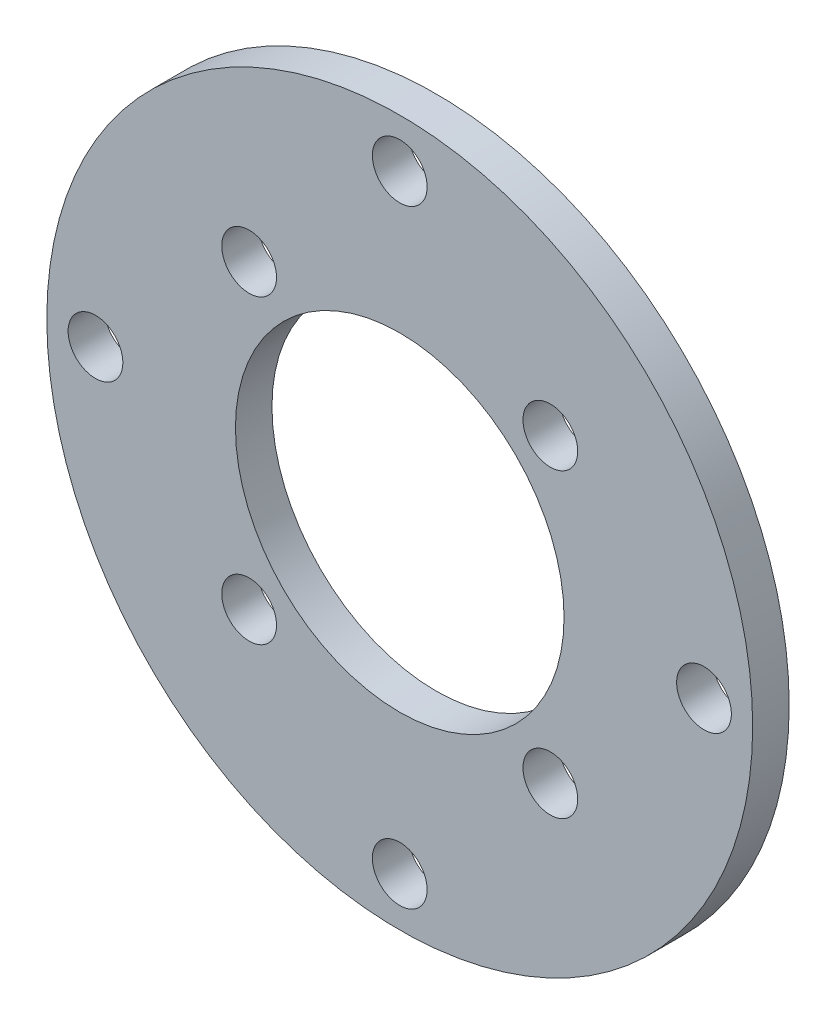
ISO-10303-21;
HEADER;
FILE_DESCRIPTION(('STEP AP214'),'2;1');
FILE_NAME('part.step','',(''),(''),'','','');
FILE_SCHEMA(('AUTOMOTIVE_DESIGN { 1 0 10303 214 1 1 1 1 }'));
ENDSEC;
DATA;
#1=APPLICATION_CONTEXT('core data for automotive mechanical design processes');
#2=APPLICATION_PROTOCOL_DEFINITION('international standard','automotive_design',2000,#1);
#3=PRODUCT_CONTEXT('',#1,'mechanical');
#4=PRODUCT('Part','Part','',(#3));
#5=PRODUCT_RELATED_PRODUCT_CATEGORY('part','',(#4));
#6=PRODUCT_DEFINITION_FORMATION('','',#4);
#7=PRODUCT_DEFINITION_CONTEXT('part definition',#1,'design');
#8=PRODUCT_DEFINITION('design','',#6,#7);
#9=PRODUCT_DEFINITION_SHAPE('','',#8);
#10=(LENGTH_UNIT() NAMED_UNIT(*) SI_UNIT(.MILLI.,.METRE.));
#11=(NAMED_UNIT(*) PLANE_ANGLE_UNIT() SI_UNIT($,.RADIAN.));
#12=(NAMED_UNIT(*) SI_UNIT($,.STERADIAN.) SOLID_ANGLE_UNIT());
#13=UNCERTAINTY_MEASURE_WITH_UNIT(LENGTH_MEASURE(1.E-05),#10,'distance_accuracy_value','');
#14=(GEOMETRIC_REPRESENTATION_CONTEXT(3) GLOBAL_UNCERTAINTY_ASSIGNED_CONTEXT((#13)) GLOBAL_UNIT_ASSIGNED_CONTEXT((#10,
#11,#12)) REPRESENTATION_CONTEXT('',''));
#15=CARTESIAN_POINT('',(0.,0.,0.));
#16=DIRECTION('',(0.,0.,1.));
#17=DIRECTION('',(1.,0.,0.));
#18=AXIS2_PLACEMENT_3D('',#15,#16,#17);
#19=CARTESIAN_POINT('',(0.,0.,3.));
#20=DIRECTION('',(0.,0.,1.));
#21=DIRECTION('',(1.,0.,0.));
#22=AXIS2_PLACEMENT_3D('',#19,#20,#21);
#23=PLANE('',#22);
#24=CARTESIAN_POINT('',(-2.29510004397621E-12,-25.,3.));
#25=DIRECTION('',(0.,0.,1.));
#26=DIRECTION('',(1.,0.,0.));
#27=AXIS2_PLACEMENT_3D('',#24,#25,#26);
#28=CIRCLE('',#27,2.25);
#29=CARTESIAN_POINT('',(2.2499999999977,-25.,3.));
#30=VERTEX_POINT('',#29);
#31=EDGE_CURVE('E104',#30,#30,#28,.T.);
#32=ORIENTED_EDGE('',*,*,#31,.F.);
#33=EDGE_LOOP('',(#32));
#34=FACE_BOUND('',#33,.T.);
#35=CARTESIAN_POINT('',(-12.3743686707647,-12.3743686707643,3.));
#36=DIRECTION('',(0.,0.,1.));
#37=DIRECTION('',(1.,0.,0.));
#38=AXIS2_PLACEMENT_3D('',#35,#36,#37);
#39=CIRCLE('',#38,2.25000000000037);
#40=CARTESIAN_POINT('',(-10.1243686707643,-12.3743686707643,3.));
#41=VERTEX_POINT('',#40);
#42=EDGE_CURVE('E88',#41,#41,#39,.T.);
#43=ORIENTED_EDGE('',*,*,#42,.F.);
#44=EDGE_LOOP('',(#43));
#45=FACE_BOUND('',#44,.T.);
#46=CARTESIAN_POINT('',(12.3743686707648,12.3743686707645,3.));
#47=DIRECTION('',(0.,0.,1.));
#48=DIRECTION('',(1.,0.,0.));
#49=AXIS2_PLACEMENT_3D('',#46,#47,#48);
#50=CIRCLE('',#49,2.25000000000037);
#51=CARTESIAN_POINT('',(14.6243686707651,12.3743686707645,3.));
#52=VERTEX_POINT('',#51);
#53=EDGE_CURVE('E72',#52,#52,#50,.T.);
#54=ORIENTED_EDGE('',*,*,#53,.F.);
#55=EDGE_LOOP('',(#54));
#56=FACE_BOUND('',#55,.T.);
#57=CARTESIAN_POINT('',(-12.3743686707644,12.3743686707647,3.));
#58=DIRECTION('',(0.,0.,1.));
#59=DIRECTION('',(1.,0.,0.));
#60=AXIS2_PLACEMENT_3D('',#57,#58,#59);
#61=CIRCLE('',#60,2.25000000000036);
#62=CARTESIAN_POINT('',(-10.1243686707641,12.3743686707647,3.));
#63=VERTEX_POINT('',#62);
#64=EDGE_CURVE('E56',#63,#63,#61,.T.);
#65=ORIENTED_EDGE('',*,*,#64,.F.);
#66=EDGE_LOOP('',(#65));
#67=FACE_BOUND('',#66,.T.);
#68=CARTESIAN_POINT('',(0.,0.,3.));
#69=DIRECTION('',(0.,0.,1.));
#70=DIRECTION('',(1.,0.,0.));
#71=AXIS2_PLACEMENT_3D('',#68,#69,#70);
#72=CIRCLE('',#71,29.);
#73=CARTESIAN_POINT('',(29.,0.,3.));
#74=VERTEX_POINT('',#73);
#75=EDGE_CURVE('E10',#74,#74,#72,.T.);
#76=ORIENTED_EDGE('',*,*,#75,.T.);
#77=EDGE_LOOP('',(#76));
#78=FACE_BOUND('',#77,.T.);
#79=CARTESIAN_POINT('',(0.,0.,3.));
#80=DIRECTION('',(0.,0.,1.));
#81=DIRECTION('',(1.,0.,0.));
#82=AXIS2_PLACEMENT_3D('',#79,#80,#81);
#83=CIRCLE('',#82,13.5);
#84=CARTESIAN_POINT('',(13.5,0.,3.));
#85=VERTEX_POINT('',#84);
#86=EDGE_CURVE('E50',#85,#85,#83,.T.);
#87=ORIENTED_EDGE('',*,*,#86,.F.);
#88=EDGE_LOOP('',(#87));
#89=FACE_BOUND('',#88,.T.);
#90=CARTESIAN_POINT('',(0.,25.,3.));
#91=DIRECTION('',(0.,0.,1.));
#92=DIRECTION('',(1.,0.,0.));
#93=AXIS2_PLACEMENT_3D('',#90,#91,#92);
#94=CIRCLE('',#93,2.25);
#95=CARTESIAN_POINT('',(2.25,25.,3.));
#96=VERTEX_POINT('',#95);
#97=EDGE_CURVE('E64',#96,#96,#94,.T.);
#98=ORIENTED_EDGE('',*,*,#97,.F.);
#99=EDGE_LOOP('',(#98));
#100=FACE_BOUND('',#99,.T.);
#101=CARTESIAN_POINT('',(12.3743686707644,-12.3743686707647,3.));
#102=DIRECTION('',(0.,0.,1.));
#103=DIRECTION('',(1.,0.,0.));
#104=AXIS2_PLACEMENT_3D('',#101,#102,#103);
#105=CIRCLE('',#104,2.25);
#106=CARTESIAN_POINT('',(14.6243686707644,-12.3743686707647,3.));
#107=VERTEX_POINT('',#106);
#108=EDGE_CURVE('E80',#107,#107,#105,.T.);
#109=ORIENTED_EDGE('',*,*,#108,.F.);
#110=EDGE_LOOP('',(#109));
#111=FACE_BOUND('',#110,.T.);
#112=CARTESIAN_POINT('',(25.,-1.1475500219881E-12,3.));
#113=DIRECTION('',(0.,0.,1.));
#114=DIRECTION('',(1.,0.,0.));
#115=AXIS2_PLACEMENT_3D('',#112,#113,#114);
#116=CIRCLE('',#115,2.25);
#117=CARTESIAN_POINT('',(27.25,-1.1475500219881E-12,3.));
#118=VERTEX_POINT('',#117);
#119=EDGE_CURVE('E96',#118,#118,#116,.T.);
#120=ORIENTED_EDGE('',*,*,#119,.F.);
#121=EDGE_LOOP('',(#120));
#122=FACE_BOUND('',#121,.T.);
#123=CARTESIAN_POINT('',(-25.,3.43709895084118E-12,3.));
#124=DIRECTION('',(0.,0.,1.));
#125=DIRECTION('',(1.,0.,0.));
#126=AXIS2_PLACEMENT_3D('',#123,#124,#125);
#127=CIRCLE('',#126,2.25);
#128=CARTESIAN_POINT('',(-22.75,3.43709895084118E-12,3.));
#129=VERTEX_POINT('',#128);
#130=EDGE_CURVE('E112',#129,#129,#127,.T.);
#131=ORIENTED_EDGE('',*,*,#130,.F.);
#132=EDGE_LOOP('',(#131));
#133=FACE_BOUND('',#132,.T.);
#134=ADVANCED_FACE('F36',(#34,#45,#56,#67,#78,#89,#100,#111,#122,#133),#23,.T.);
#135=CARTESIAN_POINT('',(0.,0.,0.));
#136=DIRECTION('',(0.,0.,1.));
#137=DIRECTION('',(1.,0.,0.));
#138=AXIS2_PLACEMENT_3D('',#135,#136,#137);
#139=PLANE('',#138);
#140=CARTESIAN_POINT('',(0.,0.,0.));
#141=DIRECTION('',(0.,0.,1.));
#142=DIRECTION('',(1.,0.,0.));
#143=AXIS2_PLACEMENT_3D('',#140,#141,#142);
#144=CIRCLE('',#143,29.);
#145=CARTESIAN_POINT('',(29.,0.,0.));
#146=VERTEX_POINT('',#145);
#147=EDGE_CURVE('E40',#146,#146,#144,.T.);
#148=ORIENTED_EDGE('',*,*,#147,.F.);
#149=EDGE_LOOP('',(#148));
#150=FACE_BOUND('',#149,.T.);
#151=CARTESIAN_POINT('',(0.,0.,0.));
#152=DIRECTION('',(0.,0.,1.));
#153=DIRECTION('',(1.,0.,0.));
#154=AXIS2_PLACEMENT_3D('',#151,#152,#153);
#155=CIRCLE('',#154,13.5);
#156=CARTESIAN_POINT('',(13.5,0.,0.));
#157=VERTEX_POINT('',#156);
#158=EDGE_CURVE('E52',#157,#157,#155,.T.);
#159=ORIENTED_EDGE('',*,*,#158,.T.);
#160=EDGE_LOOP('',(#159));
#161=FACE_BOUND('',#160,.T.);
#162=CARTESIAN_POINT('',(-12.3743686707644,12.3743686707647,0.));
#163=DIRECTION('',(0.,0.,1.));
#164=DIRECTION('',(1.,0.,0.));
#165=AXIS2_PLACEMENT_3D('',#162,#163,#164);
#166=CIRCLE('',#165,2.25000000000036);
#167=CARTESIAN_POINT('',(-10.1243686707641,12.3743686707647,0.));
#168=VERTEX_POINT('',#167);
#169=EDGE_CURVE('E60',#168,#168,#166,.T.);
#170=ORIENTED_EDGE('',*,*,#169,.T.);
#171=EDGE_LOOP('',(#170));
#172=FACE_BOUND('',#171,.T.);
#173=CARTESIAN_POINT('',(0.,25.,0.));
#174=DIRECTION('',(0.,0.,1.));
#175=DIRECTION('',(1.,0.,0.));
#176=AXIS2_PLACEMENT_3D('',#173,#174,#175);
#177=CIRCLE('',#176,2.25);
#178=CARTESIAN_POINT('',(2.25,25.,0.));
#179=VERTEX_POINT('',#178);
#180=EDGE_CURVE('E68',#179,#179,#177,.T.);
#181=ORIENTED_EDGE('',*,*,#180,.T.);
#182=EDGE_LOOP('',(#181));
#183=FACE_BOUND('',#182,.T.);
#184=CARTESIAN_POINT('',(12.3743686707648,12.3743686707645,0.));
#185=DIRECTION('',(0.,0.,1.));
#186=DIRECTION('',(1.,0.,0.));
#187=AXIS2_PLACEMENT_3D('',#184,#185,#186);
#188=CIRCLE('',#187,2.25000000000037);
#189=CARTESIAN_POINT('',(14.6243686707651,12.3743686707645,0.));
#190=VERTEX_POINT('',#189);
#191=EDGE_CURVE('E76',#190,#190,#188,.T.);
#192=ORIENTED_EDGE('',*,*,#191,.T.);
#193=EDGE_LOOP('',(#192));
#194=FACE_BOUND('',#193,.T.);
#195=CARTESIAN_POINT('',(12.3743686707644,-12.3743686707647,0.));
#196=DIRECTION('',(0.,0.,1.));
#197=DIRECTION('',(1.,0.,0.));
#198=AXIS2_PLACEMENT_3D('',#195,#196,#197);
#199=CIRCLE('',#198,2.25);
#200=CARTESIAN_POINT('',(14.6243686707644,-12.3743686707647,0.));
#201=VERTEX_POINT('',#200);
#202=EDGE_CURVE('E84',#201,#201,#199,.T.);
#203=ORIENTED_EDGE('',*,*,#202,.T.);
#204=EDGE_LOOP('',(#203));
#205=FACE_BOUND('',#204,.T.);
#206=CARTESIAN_POINT('',(-12.3743686707647,-12.3743686707643,0.));
#207=DIRECTION('',(0.,0.,1.));
#208=DIRECTION('',(1.,0.,0.));
#209=AXIS2_PLACEMENT_3D('',#206,#207,#208);
#210=CIRCLE('',#209,2.25000000000037);
#211=CARTESIAN_POINT('',(-10.1243686707643,-12.3743686707643,0.));
#212=VERTEX_POINT('',#211);
#213=EDGE_CURVE('E92',#212,#212,#210,.T.);
#214=ORIENTED_EDGE('',*,*,#213,.T.);
#215=EDGE_LOOP('',(#214));
#216=FACE_BOUND('',#215,.T.);
#217=CARTESIAN_POINT('',(25.,-1.1475500219881E-12,0.));
#218=DIRECTION('',(0.,0.,1.));
#219=DIRECTION('',(1.,0.,0.));
#220=AXIS2_PLACEMENT_3D('',#217,#218,#219);
#221=CIRCLE('',#220,2.25);
#222=CARTESIAN_POINT('',(27.25,-1.1475500219881E-12,0.));
#223=VERTEX_POINT('',#222);
#224=EDGE_CURVE('E100',#223,#223,#221,.T.);
#225=ORIENTED_EDGE('',*,*,#224,.T.);
#226=EDGE_LOOP('',(#225));
#227=FACE_BOUND('',#226,.T.);
#228=CARTESIAN_POINT('',(-2.29510004397621E-12,-25.,0.));
#229=DIRECTION('',(0.,0.,1.));
#230=DIRECTION('',(1.,0.,0.));
#231=AXIS2_PLACEMENT_3D('',#228,#229,#230);
#232=CIRCLE('',#231,2.25);
#233=CARTESIAN_POINT('',(2.2499999999977,-25.,0.));
#234=VERTEX_POINT('',#233);
#235=EDGE_CURVE('E108',#234,#234,#232,.T.);
#236=ORIENTED_EDGE('',*,*,#235,.T.);
#237=EDGE_LOOP('',(#236));
#238=FACE_BOUND('',#237,.T.);
#239=CARTESIAN_POINT('',(-25.,3.43709895084118E-12,0.));
#240=DIRECTION('',(0.,0.,1.));
#241=DIRECTION('',(1.,0.,0.));
#242=AXIS2_PLACEMENT_3D('',#239,#240,#241);
#243=CIRCLE('',#242,2.25);
#244=CARTESIAN_POINT('',(-22.75,3.43709895084118E-12,0.));
#245=VERTEX_POINT('',#244);
#246=EDGE_CURVE('E116',#245,#245,#243,.T.);
#247=ORIENTED_EDGE('',*,*,#246,.T.);
#248=EDGE_LOOP('',(#247));
#249=FACE_BOUND('',#248,.T.);
#250=ADVANCED_FACE('F129',(#150,#161,#172,#183,#194,#205,#216,#227,#238,#249),#139,.F.);
#251=CARTESIAN_POINT('',(0.,0.,3.));
#252=DIRECTION('',(0.,0.,-1.));
#253=DIRECTION('',(-1.,0.,0.));
#254=AXIS2_PLACEMENT_3D('',#251,#252,#253);
#255=CYLINDRICAL_SURFACE('',#254,29.);
#256=ORIENTED_EDGE('',*,*,#75,.F.);
#257=EDGE_LOOP('',(#256));
#258=FACE_BOUND('',#257,.T.);
#259=ORIENTED_EDGE('',*,*,#147,.T.);
#260=EDGE_LOOP('',(#259));
#261=FACE_BOUND('',#260,.T.);
#262=ADVANCED_FACE('F38',(#258,#261),#255,.T.);
#263=CARTESIAN_POINT('',(0.,0.,3.));
#264=DIRECTION('',(0.,0.,-1.));
#265=DIRECTION('',(-1.,0.,0.));
#266=AXIS2_PLACEMENT_3D('',#263,#264,#265);
#267=CYLINDRICAL_SURFACE('',#266,13.5);
#268=ORIENTED_EDGE('',*,*,#86,.T.);
#269=EDGE_LOOP('',(#268));
#270=FACE_BOUND('',#269,.T.);
#271=ORIENTED_EDGE('',*,*,#158,.F.);
#272=EDGE_LOOP('',(#271));
#273=FACE_BOUND('',#272,.T.);
#274=ADVANCED_FACE('F139',(#270,#273),#267,.F.);
#275=CARTESIAN_POINT('',(-12.3743686707644,12.3743686707647,3.));
#276=DIRECTION('',(0.,0.,-1.));
#277=DIRECTION('',(-1.,0.,0.));
#278=AXIS2_PLACEMENT_3D('',#275,#276,#277);
#279=CYLINDRICAL_SURFACE('',#278,2.25000000000036);
#280=ORIENTED_EDGE('',*,*,#64,.T.);
#281=EDGE_LOOP('',(#280));
#282=FACE_BOUND('',#281,.T.);
#283=ORIENTED_EDGE('',*,*,#169,.F.);
#284=EDGE_LOOP('',(#283));
#285=FACE_BOUND('',#284,.T.);
#286=ADVANCED_FACE('F142',(#282,#285),#279,.F.);
#287=CARTESIAN_POINT('',(0.,25.,3.));
#288=DIRECTION('',(0.,0.,-1.));
#289=DIRECTION('',(-1.,0.,0.));
#290=AXIS2_PLACEMENT_3D('',#287,#288,#289);
#291=CYLINDRICAL_SURFACE('',#290,2.25);
#292=ORIENTED_EDGE('',*,*,#97,.T.);
#293=EDGE_LOOP('',(#292));
#294=FACE_BOUND('',#293,.T.);
#295=ORIENTED_EDGE('',*,*,#180,.F.);
#296=EDGE_LOOP('',(#295));
#297=FACE_BOUND('',#296,.T.);
#298=ADVANCED_FACE('F146',(#294,#297),#291,.F.);
#299=CARTESIAN_POINT('',(12.3743686707648,12.3743686707645,3.));
#300=DIRECTION('',(0.,0.,-1.));
#301=DIRECTION('',(-1.,0.,0.));
#302=AXIS2_PLACEMENT_3D('',#299,#300,#301);
#303=CYLINDRICAL_SURFACE('',#302,2.25000000000037);
#304=ORIENTED_EDGE('',*,*,#53,.T.);
#305=EDGE_LOOP('',(#304));
#306=FACE_BOUND('',#305,.T.);
#307=ORIENTED_EDGE('',*,*,#191,.F.);
#308=EDGE_LOOP('',(#307));
#309=FACE_BOUND('',#308,.T.);
#310=ADVANCED_FACE('F150',(#306,#309),#303,.F.);
#311=CARTESIAN_POINT('',(12.3743686707644,-12.3743686707647,3.));
#312=DIRECTION('',(0.,0.,-1.));
#313=DIRECTION('',(-1.,0.,0.));
#314=AXIS2_PLACEMENT_3D('',#311,#312,#313);
#315=CYLINDRICAL_SURFACE('',#314,2.25);
#316=ORIENTED_EDGE('',*,*,#108,.T.);
#317=EDGE_LOOP('',(#316));
#318=FACE_BOUND('',#317,.T.);
#319=ORIENTED_EDGE('',*,*,#202,.F.);
#320=EDGE_LOOP('',(#319));
#321=FACE_BOUND('',#320,.T.);
#322=ADVANCED_FACE('F154',(#318,#321),#315,.F.);
#323=CARTESIAN_POINT('',(-12.3743686707647,-12.3743686707643,3.));
#324=DIRECTION('',(0.,0.,-1.));
#325=DIRECTION('',(-1.,0.,0.));
#326=AXIS2_PLACEMENT_3D('',#323,#324,#325);
#327=CYLINDRICAL_SURFACE('',#326,2.25000000000037);
#328=ORIENTED_EDGE('',*,*,#42,.T.);
#329=EDGE_LOOP('',(#328));
#330=FACE_BOUND('',#329,.T.);
#331=ORIENTED_EDGE('',*,*,#213,.F.);
#332=EDGE_LOOP('',(#331));
#333=FACE_BOUND('',#332,.T.);
#334=ADVANCED_FACE('F158',(#330,#333),#327,.F.);
#335=CARTESIAN_POINT('',(25.,-1.1475500219881E-12,3.));
#336=DIRECTION('',(0.,0.,-1.));
#337=DIRECTION('',(-1.,0.,0.));
#338=AXIS2_PLACEMENT_3D('',#335,#336,#337);
#339=CYLINDRICAL_SURFACE('',#338,2.25);
#340=ORIENTED_EDGE('',*,*,#119,.T.);
#341=EDGE_LOOP('',(#340));
#342=FACE_BOUND('',#341,.T.);
#343=ORIENTED_EDGE('',*,*,#224,.F.);
#344=EDGE_LOOP('',(#343));
#345=FACE_BOUND('',#344,.T.);
#346=ADVANCED_FACE('F162',(#342,#345),#339,.F.);
#347=CARTESIAN_POINT('',(-2.29510004397621E-12,-25.,3.));
#348=DIRECTION('',(0.,0.,-1.));
#349=DIRECTION('',(-1.,0.,0.));
#350=AXIS2_PLACEMENT_3D('',#347,#348,#349);
#351=CYLINDRICAL_SURFACE('',#350,2.25);
#352=ORIENTED_EDGE('',*,*,#31,.T.);
#353=EDGE_LOOP('',(#352));
#354=FACE_BOUND('',#353,.T.);
#355=ORIENTED_EDGE('',*,*,#235,.F.);
#356=EDGE_LOOP('',(#355));
#357=FACE_BOUND('',#356,.T.);
#358=ADVANCED_FACE('F166',(#354,#357),#351,.F.);
#359=CARTESIAN_POINT('',(-25.,3.43709895084118E-12,3.));
#360=DIRECTION('',(0.,0.,-1.));
#361=DIRECTION('',(-1.,0.,0.));
#362=AXIS2_PLACEMENT_3D('',#359,#360,#361);
#363=CYLINDRICAL_SURFACE('',#362,2.25);
#364=ORIENTED_EDGE('',*,*,#130,.T.);
#365=EDGE_LOOP('',(#364));
#366=FACE_BOUND('',#365,.T.);
#367=ORIENTED_EDGE('',*,*,#246,.F.);
#368=EDGE_LOOP('',(#367));
#369=FACE_BOUND('',#368,.T.);
#370=ADVANCED_FACE('F125',(#366,#369),#363,.F.);
#371=CLOSED_SHELL('',(#134,#250,#262,#274,#286,#298,#310,#322,#334,#346,#358,#370));
#372=MANIFOLD_SOLID_BREP('B2',#371);
#373=ADVANCED_BREP_SHAPE_REPRESENTATION('',(#18,#372),#14);
#374=SHAPE_DEFINITION_REPRESENTATION(#9,#373);
ENDSEC;
END-ISO-10303-21;
